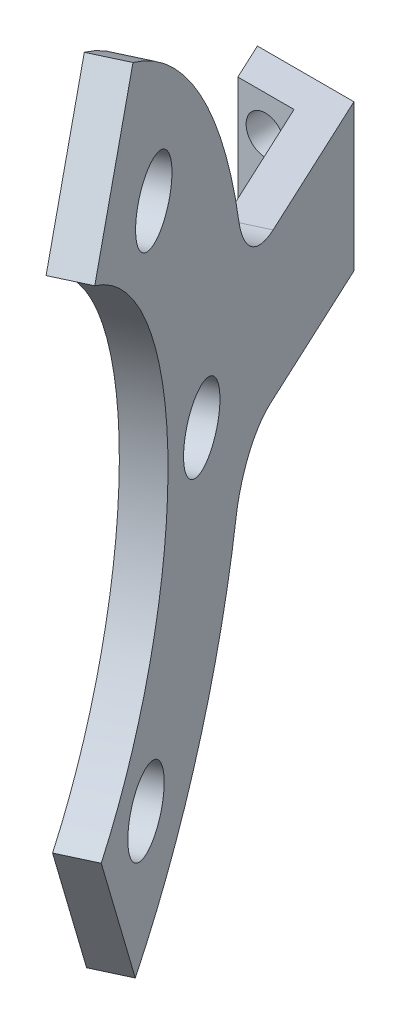
ISO-10303-21;
HEADER;
FILE_DESCRIPTION(('STEP AP214'),'2;1');
FILE_NAME('part.step','',(''),(''),'','','');
FILE_SCHEMA(('AUTOMOTIVE_DESIGN { 1 0 10303 214 1 1 1 1 }'));
ENDSEC;
DATA;
#1=APPLICATION_CONTEXT('core data for automotive mechanical design processes');
#2=APPLICATION_PROTOCOL_DEFINITION('international standard','automotive_design',2000,#1);
#3=PRODUCT_CONTEXT('',#1,'mechanical');
#4=PRODUCT('Part','Part','',(#3));
#5=PRODUCT_RELATED_PRODUCT_CATEGORY('part','',(#4));
#6=PRODUCT_DEFINITION_FORMATION('','',#4);
#7=PRODUCT_DEFINITION_CONTEXT('part definition',#1,'design');
#8=PRODUCT_DEFINITION('design','',#6,#7);
#9=PRODUCT_DEFINITION_SHAPE('','',#8);
#10=(LENGTH_UNIT() NAMED_UNIT(*) SI_UNIT(.MILLI.,.METRE.));
#11=(NAMED_UNIT(*) PLANE_ANGLE_UNIT() SI_UNIT($,.RADIAN.));
#12=(NAMED_UNIT(*) SI_UNIT($,.STERADIAN.) SOLID_ANGLE_UNIT());
#13=UNCERTAINTY_MEASURE_WITH_UNIT(LENGTH_MEASURE(1.E-05),#10,'distance_accuracy_value','');
#14=(GEOMETRIC_REPRESENTATION_CONTEXT(3) GLOBAL_UNCERTAINTY_ASSIGNED_CONTEXT((#13)) GLOBAL_UNIT_ASSIGNED_CONTEXT((#10,
#11,#12)) REPRESENTATION_CONTEXT('',''));
#15=CARTESIAN_POINT('',(0.,0.,0.));
#16=DIRECTION('',(0.,0.,1.));
#17=DIRECTION('',(1.,0.,0.));
#18=AXIS2_PLACEMENT_3D('',#15,#16,#17);
#19=CARTESIAN_POINT('',(21.9969620581679,8.,0.));
#20=DIRECTION('',(0.906307787036651,0.,-0.422618261740697));
#21=DIRECTION('',(-0.422618261740697,0.,-0.906307787036651));
#22=AXIS2_PLACEMENT_3D('',#19,#20,#21);
#23=PLANE('',#22);
#24=DIRECTION('',(0.422618261740697,0.,0.906307787036651));
#25=VECTOR('',#24,1.);
#26=CARTESIAN_POINT('',(21.9969620581679,0.,0.));
#27=LINE('',#26,#25);
#28=CARTESIAN_POINT('',(21.9969620581679,0.,0.));
#29=VERTEX_POINT('',#28);
#30=CARTESIAN_POINT('',(22.9295773744779,0.,2.));
#31=VERTEX_POINT('',#30);
#32=EDGE_CURVE('E162',#29,#31,#27,.T.);
#33=ORIENTED_EDGE('',*,*,#32,.T.);
#34=DIRECTION('',(0.,-1.,0.));
#35=VECTOR('',#34,1.);
#36=CARTESIAN_POINT('',(22.9295773744779,8.,2.));
#37=LINE('',#36,#35);
#38=CARTESIAN_POINT('',(22.9295773744779,8.,2.));
#39=VERTEX_POINT('',#38);
#40=EDGE_CURVE('E212',#39,#31,#37,.T.);
#41=ORIENTED_EDGE('',*,*,#40,.F.);
#42=DIRECTION('',(0.422618261740697,0.,0.906307787036651));
#43=VECTOR('',#42,1.);
#44=CARTESIAN_POINT('',(21.9969620581679,8.,0.));
#45=LINE('',#44,#43);
#46=CARTESIAN_POINT('',(21.9969620581679,8.,0.));
#47=VERTEX_POINT('',#46);
#48=EDGE_CURVE('E168',#47,#39,#45,.T.);
#49=ORIENTED_EDGE('',*,*,#48,.F.);
#50=DIRECTION('',(0.,-1.,0.));
#51=VECTOR('',#50,1.);
#52=CARTESIAN_POINT('',(21.9969620581679,8.,0.));
#53=LINE('',#52,#51);
#54=EDGE_CURVE('E185',#47,#29,#53,.T.);
#55=ORIENTED_EDGE('',*,*,#54,.T.);
#56=EDGE_LOOP('',(#33,#41,#49,#55));
#57=FACE_BOUND('',#56,.T.);
#58=ADVANCED_FACE('F40',(#57),#23,.F.);
#59=CARTESIAN_POINT('',(22.9295773744779,8.,2.));
#60=DIRECTION('',(0.,0.,-1.));
#61=DIRECTION('',(-1.,0.,0.));
#62=AXIS2_PLACEMENT_3D('',#59,#60,#61);
#63=PLANE('',#62);
#64=CARTESIAN_POINT('',(24.4295773744779,6.,2.));
#65=DIRECTION('',(0.,0.,1.));
#66=DIRECTION('',(1.,0.,0.));
#67=AXIS2_PLACEMENT_3D('',#64,#65,#66);
#68=CIRCLE('',#67,1.05);
#69=CARTESIAN_POINT('',(25.4795773744779,6.,2.));
#70=VERTEX_POINT('',#69);
#71=EDGE_CURVE('E322',#70,#70,#68,.T.);
#72=ORIENTED_EDGE('',*,*,#71,.F.);
#73=EDGE_LOOP('',(#72));
#74=FACE_BOUND('',#73,.T.);
#75=CARTESIAN_POINT('',(24.4295773744779,2.,2.));
#76=DIRECTION('',(0.,0.,1.));
#77=DIRECTION('',(1.,0.,0.));
#78=AXIS2_PLACEMENT_3D('',#75,#76,#77);
#79=CIRCLE('',#78,1.05);
#80=CARTESIAN_POINT('',(25.4795773744779,2.,2.));
#81=VERTEX_POINT('',#80);
#82=EDGE_CURVE('E314',#81,#81,#79,.T.);
#83=ORIENTED_EDGE('',*,*,#82,.F.);
#84=EDGE_LOOP('',(#83));
#85=FACE_BOUND('',#84,.T.);
#86=DIRECTION('',(1.,0.,0.));
#87=VECTOR('',#86,1.);
#88=CARTESIAN_POINT('',(22.9295773744779,0.,2.));
#89=LINE('',#88,#87);
#90=CARTESIAN_POINT('',(25.9969620581679,0.,2.));
#91=VERTEX_POINT('',#90);
#92=EDGE_CURVE('E189',#31,#91,#89,.T.);
#93=ORIENTED_EDGE('',*,*,#92,.T.);
#94=DIRECTION('',(0.,-1.,0.));
#95=VECTOR('',#94,1.);
#96=CARTESIAN_POINT('',(25.9969620581679,8.,2.));
#97=LINE('',#96,#95);
#98=CARTESIAN_POINT('',(25.9969620581679,8.,2.));
#99=VERTEX_POINT('',#98);
#100=EDGE_CURVE('E208',#99,#91,#97,.T.);
#101=ORIENTED_EDGE('',*,*,#100,.F.);
#102=DIRECTION('',(1.,0.,0.));
#103=VECTOR('',#102,1.);
#104=CARTESIAN_POINT('',(22.9295773744779,8.,2.));
#105=LINE('',#104,#103);
#106=EDGE_CURVE('E172',#39,#99,#105,.T.);
#107=ORIENTED_EDGE('',*,*,#106,.F.);
#108=ORIENTED_EDGE('',*,*,#40,.T.);
#109=EDGE_LOOP('',(#93,#101,#107,#108));
#110=FACE_BOUND('',#109,.T.);
#111=ADVANCED_FACE('F340',(#74,#85,#110),#63,.F.);
#112=CARTESIAN_POINT('',(25.9969620581679,8.,2.));
#113=DIRECTION('',(0.906307787036651,0.,-0.422618261740697));
#114=DIRECTION('',(-0.422618261740697,0.,-0.906307787036651));
#115=AXIS2_PLACEMENT_3D('',#112,#113,#114);
#116=PLANE('',#115);
#117=DIRECTION('',(0.422618261740697,0.,0.906307787036651));
#118=VECTOR('',#117,1.);
#119=CARTESIAN_POINT('',(25.9969620581679,0.,2.));
#120=LINE('',#119,#118);
#121=CARTESIAN_POINT('',(29.4639816523189,0.,9.43504751319924));
#122=VERTEX_POINT('',#121);
#123=EDGE_CURVE('E192',#91,#122,#120,.T.);
#124=ORIENTED_EDGE('',*,*,#123,.T.);
#125=CARTESIAN_POINT('',(29.463981652319,-4.,9.43504751319924));
#126=DIRECTION('',(0.906307787036651,0.,-0.422618261740697));
#127=DIRECTION('',(-0.422618261740697,0.,-0.906307787036651));
#128=AXIS2_PLACEMENT_3D('',#125,#126,#127);
#129=CIRCLE('',#128,4.);
#130=CARTESIAN_POINT('',(31.0780209575543,-2.81081892074349,12.8963659732508));
#131=VERTEX_POINT('',#130);
#132=EDGE_CURVE('E249',#122,#131,#129,.T.);
#133=ORIENTED_EDGE('',*,*,#132,.T.);
#134=CARTESIAN_POINT('',(41.1657666152749,4.62156282460973,34.5296063485732));
#135=DIRECTION('',(0.906307787036651,0.,-0.422618261740697));
#136=DIRECTION('',(-0.422618261740697,0.,-0.906307787036651));
#137=AXIS2_PLACEMENT_3D('',#134,#135,#136);
#138=CIRCLE('',#137,25.);
#139=CARTESIAN_POINT('',(30.9480034984025,10.9822845275324,12.6175426323129));
#140=VERTEX_POINT('',#139);
#141=EDGE_CURVE('E158',#131,#140,#138,.T.);
#142=ORIENTED_EDGE('',*,*,#141,.T.);
#143=CARTESIAN_POINT('',(29.313161399703,12.,9.11161243771124));
#144=DIRECTION('',(0.906307787036651,0.,-0.422618261740697));
#145=DIRECTION('',(-0.422618261740697,0.,-0.906307787036651));
#146=AXIS2_PLACEMENT_3D('',#143,#144,#145);
#147=CIRCLE('',#146,4.);
#148=CARTESIAN_POINT('',(29.313161399703,8.,9.11161243771124));
#149=VERTEX_POINT('',#148);
#150=EDGE_CURVE('E11',#140,#149,#147,.T.);
#151=ORIENTED_EDGE('',*,*,#150,.T.);
#152=DIRECTION('',(0.422618261740697,0.,0.906307787036651));
#153=VECTOR('',#152,1.);
#154=CARTESIAN_POINT('',(25.9969620581679,8.,2.));
#155=LINE('',#154,#153);
#156=EDGE_CURVE('E176',#99,#149,#155,.T.);
#157=ORIENTED_EDGE('',*,*,#156,.F.);
#158=ORIENTED_EDGE('',*,*,#100,.T.);
#159=EDGE_LOOP('',(#124,#133,#142,#151,#157,#158));
#160=FACE_BOUND('',#159,.T.);
#161=ADVANCED_FACE('F268',(#160),#116,.F.);
#162=CARTESIAN_POINT('',(27.2670300453605,8.,0.));
#163=DIRECTION('',(-0.906307787036651,0.,0.422618261740697));
#164=DIRECTION('',(0.422618261740697,0.,0.906307787036651));
#165=AXIS2_PLACEMENT_3D('',#162,#163,#164);
#166=PLANE('',#165);
#167=CARTESIAN_POINT('',(37.1869447665047,-9.9532528405021,21.2733257703586));
#168=DIRECTION('',(-0.906307787036651,0.,0.422618261740697));
#169=DIRECTION('',(0.422618261740697,0.,0.906307787036651));
#170=AXIS2_PLACEMENT_3D('',#167,#168,#169);
#171=CIRCLE('',#170,2.04999999999999);
#172=CARTESIAN_POINT('',(38.0533122030731,-9.9532528405021,23.1312567337837));
#173=VERTEX_POINT('',#172);
#174=EDGE_CURVE('E232',#173,#173,#171,.F.);
#175=ORIENTED_EDGE('',*,*,#174,.F.);
#176=EDGE_LOOP('',(#175));
#177=FACE_BOUND('',#176,.T.);
#178=CARTESIAN_POINT('',(36.8154537732224,18.3173559132924,20.4766607643577));
#179=DIRECTION('',(-0.906307787036651,0.,0.422618261740697));
#180=DIRECTION('',(0.422618261740697,0.,0.906307787036651));
#181=AXIS2_PLACEMENT_3D('',#178,#179,#180);
#182=CIRCLE('',#181,2.04999999999999);
#183=CARTESIAN_POINT('',(37.6818212097908,18.3173559132924,22.3345917277828));
#184=VERTEX_POINT('',#183);
#185=EDGE_CURVE('E227',#184,#184,#182,.F.);
#186=ORIENTED_EDGE('',*,*,#185,.F.);
#187=EDGE_LOOP('',(#186));
#188=FACE_BOUND('',#187,.T.);
#189=CARTESIAN_POINT('',(34.5267546482088,4.,15.5685296518019));
#190=DIRECTION('',(-0.906307787036651,0.,0.422618261740697));
#191=DIRECTION('',(0.422618261740697,0.,0.906307787036651));
#192=AXIS2_PLACEMENT_3D('',#189,#190,#191);
#193=CIRCLE('',#192,2.05);
#194=CARTESIAN_POINT('',(35.3931220847773,4.,17.4264606152271));
#195=VERTEX_POINT('',#194);
#196=EDGE_CURVE('E221',#195,#195,#193,.F.);
#197=ORIENTED_EDGE('',*,*,#196,.F.);
#198=EDGE_LOOP('',(#197));
#199=FACE_BOUND('',#198,.T.);
#200=DIRECTION('',(-0.422618261740697,0.,-0.906307787036651));
#201=VECTOR('',#200,1.);
#202=CARTESIAN_POINT('',(27.2670300453605,8.,0.));
#203=LINE('',#202,#201);
#204=CARTESIAN_POINT('',(31.1224318192317,8.,8.2679357854117));
#205=VERTEX_POINT('',#204);
#206=CARTESIAN_POINT('',(27.2670300453605,8.,0.));
#207=VERTEX_POINT('',#206);
#208=EDGE_CURVE('E179',#205,#207,#203,.T.);
#209=ORIENTED_EDGE('',*,*,#208,.F.);
#210=CARTESIAN_POINT('',(31.1224318192317,12.,8.2679357854117));
#211=DIRECTION('',(-0.906307787036651,0.,0.422618261740697));
#212=DIRECTION('',(0.422618261740697,0.,0.906307787036651));
#213=AXIS2_PLACEMENT_3D('',#210,#211,#212);
#214=CIRCLE('',#213,4.);
#215=CARTESIAN_POINT('',(32.7572739179313,10.9822845275324,11.7738659800133));
#216=VERTEX_POINT('',#215);
#217=EDGE_CURVE('E49',#205,#216,#214,.T.);
#218=ORIENTED_EDGE('',*,*,#217,.T.);
#219=CARTESIAN_POINT('',(42.9750370348036,4.62156282460973,33.6859296962736));
#220=DIRECTION('',(0.906307787036651,0.,-0.422618261740697));
#221=DIRECTION('',(-0.422618261740697,0.,-0.906307787036651));
#222=AXIS2_PLACEMENT_3D('',#219,#220,#221);
#223=CIRCLE('',#222,25.);
#224=CARTESIAN_POINT('',(37.8086821258694,26.4288608276341,22.6066458402556));
#225=VERTEX_POINT('',#224);
#226=EDGE_CURVE('E257',#216,#225,#223,.T.);
#227=ORIENTED_EDGE('',*,*,#226,.T.);
#228=DIRECTION('',(-0.206699302648591,0.872232080991051,-0.443268084994405));
#229=VECTOR('',#228,1.);
#230=CARTESIAN_POINT('',(39.6317016030034,18.7360623911966,26.5161237251932));
#231=LINE('',#230,#229);
#232=CARTESIAN_POINT('',(39.6317016030034,18.7360623911966,26.5161237251932));
#233=VERTEX_POINT('',#232);
#234=EDGE_CURVE('E263',#233,#225,#231,.T.);
#235=ORIENTED_EDGE('',*,*,#234,.F.);
#236=CARTESIAN_POINT('',(42.9750370348036,4.62156282460973,33.6859296962736));
#237=DIRECTION('',(0.906307787036651,0.,-0.422618261740697));
#238=DIRECTION('',(-0.422618261740697,0.,-0.906307787036651));
#239=AXIS2_PLACEMENT_3D('',#236,#237,#238);
#240=CIRCLE('',#239,16.1803308831325);
#241=CARTESIAN_POINT('',(39.3225517266587,-9.05725348798949,25.8531496758973));
#242=VERTEX_POINT('',#241);
#243=EDGE_CURVE('E156',#242,#233,#240,.T.);
#244=ORIENTED_EDGE('',*,*,#243,.F.);
#245=DIRECTION('',(-0.183398964974215,-0.900932658221316,-0.393300349601497));
#246=VECTOR('',#245,1.);
#247=CARTESIAN_POINT('',(39.3225517266587,-9.05725348798949,25.8531496758973));
#248=LINE('',#247,#246);
#249=CARTESIAN_POINT('',(37.6981420339057,-17.0370353953642,22.3695918480456));
#250=VERTEX_POINT('',#249);
#251=EDGE_CURVE('E152',#242,#250,#248,.T.);
#252=ORIENTED_EDGE('',*,*,#251,.T.);
#253=CARTESIAN_POINT('',(32.887291377083,-2.81081892074349,12.0526893209513));
#254=VERTEX_POINT('',#253);
#255=EDGE_CURVE('E262',#250,#254,#223,.T.);
#256=ORIENTED_EDGE('',*,*,#255,.T.);
#257=CARTESIAN_POINT('',(31.2732520718477,-4.,8.5913708608997));
#258=DIRECTION('',(-0.906307787036651,0.,0.422618261740697));
#259=DIRECTION('',(0.422618261740697,0.,0.906307787036651));
#260=AXIS2_PLACEMENT_3D('',#257,#258,#259);
#261=CIRCLE('',#260,4.);
#262=CARTESIAN_POINT('',(31.2732520718477,0.,8.5913708608997));
#263=VERTEX_POINT('',#262);
#264=EDGE_CURVE('E246',#254,#263,#261,.T.);
#265=ORIENTED_EDGE('',*,*,#264,.T.);
#266=DIRECTION('',(-0.422618261740697,0.,-0.906307787036651));
#267=VECTOR('',#266,1.);
#268=CARTESIAN_POINT('',(27.2670300453605,0.,0.));
#269=LINE('',#268,#267);
#270=CARTESIAN_POINT('',(27.2670300453605,0.,0.));
#271=VERTEX_POINT('',#270);
#272=EDGE_CURVE('E196',#263,#271,#269,.T.);
#273=ORIENTED_EDGE('',*,*,#272,.T.);
#274=DIRECTION('',(0.,-1.,0.));
#275=VECTOR('',#274,1.);
#276=CARTESIAN_POINT('',(27.2670300453605,8.,0.));
#277=LINE('',#276,#275);
#278=EDGE_CURVE('E204',#207,#271,#277,.T.);
#279=ORIENTED_EDGE('',*,*,#278,.F.);
#280=EDGE_LOOP('',(#209,#218,#227,#235,#244,#252,#256,#265,#273,#279));
#281=FACE_BOUND('',#280,.T.);
#282=ADVANCED_FACE('F256',(#177,#188,#199,#281),#166,.F.);
#283=CARTESIAN_POINT('',(27.2670300453605,8.,0.));
#284=DIRECTION('',(0.,0.,1.));
#285=DIRECTION('',(1.,0.,0.));
#286=AXIS2_PLACEMENT_3D('',#283,#284,#285);
#287=PLANE('',#286);
#288=CARTESIAN_POINT('',(24.4295773744779,6.,0.));
#289=DIRECTION('',(0.,0.,1.));
#290=DIRECTION('',(1.,0.,0.));
#291=AXIS2_PLACEMENT_3D('',#288,#289,#290);
#292=CIRCLE('',#291,1.05);
#293=CARTESIAN_POINT('',(25.4795773744779,6.,0.));
#294=VERTEX_POINT('',#293);
#295=EDGE_CURVE('E222',#294,#294,#292,.T.);
#296=ORIENTED_EDGE('',*,*,#295,.T.);
#297=EDGE_LOOP('',(#296));
#298=FACE_BOUND('',#297,.T.);
#299=CARTESIAN_POINT('',(24.4295773744779,2.,0.));
#300=DIRECTION('',(0.,0.,1.));
#301=DIRECTION('',(1.,0.,0.));
#302=AXIS2_PLACEMENT_3D('',#299,#300,#301);
#303=CIRCLE('',#302,1.05);
#304=CARTESIAN_POINT('',(25.4795773744779,2.,0.));
#305=VERTEX_POINT('',#304);
#306=EDGE_CURVE('E318',#305,#305,#303,.T.);
#307=ORIENTED_EDGE('',*,*,#306,.T.);
#308=EDGE_LOOP('',(#307));
#309=FACE_BOUND('',#308,.T.);
#310=DIRECTION('',(-1.,0.,0.));
#311=VECTOR('',#310,1.);
#312=CARTESIAN_POINT('',(27.2670300453605,0.,0.));
#313=LINE('',#312,#311);
#314=EDGE_CURVE('E173',#271,#29,#313,.T.);
#315=ORIENTED_EDGE('',*,*,#314,.T.);
#316=ORIENTED_EDGE('',*,*,#54,.F.);
#317=DIRECTION('',(-1.,0.,0.));
#318=VECTOR('',#317,1.);
#319=CARTESIAN_POINT('',(27.2670300453605,8.,0.));
#320=LINE('',#319,#318);
#321=EDGE_CURVE('E182',#207,#47,#320,.T.);
#322=ORIENTED_EDGE('',*,*,#321,.F.);
#323=ORIENTED_EDGE('',*,*,#278,.T.);
#324=EDGE_LOOP('',(#315,#316,#322,#323));
#325=FACE_BOUND('',#324,.T.);
#326=ADVANCED_FACE('F330',(#298,#309,#325),#287,.F.);
#327=CARTESIAN_POINT('',(0.,8.,0.));
#328=DIRECTION('',(0.,-1.,0.));
#329=DIRECTION('',(0.,0.,-1.));
#330=AXIS2_PLACEMENT_3D('',#327,#328,#329);
#331=PLANE('',#330);
#332=ORIENTED_EDGE('',*,*,#156,.T.);
#333=DIRECTION('',(0.906307787036651,0.,-0.422618261740697));
#334=VECTOR('',#333,1.);
#335=CARTESIAN_POINT('',(8.72546226349724,8.,18.711814208715));
#336=LINE('',#335,#334);
#337=EDGE_CURVE('E243',#149,#205,#336,.T.);
#338=ORIENTED_EDGE('',*,*,#337,.T.);
#339=ORIENTED_EDGE('',*,*,#208,.T.);
#340=ORIENTED_EDGE('',*,*,#321,.T.);
#341=ORIENTED_EDGE('',*,*,#48,.T.);
#342=ORIENTED_EDGE('',*,*,#106,.T.);
#343=EDGE_LOOP('',(#332,#338,#339,#340,#341,#342));
#344=FACE_BOUND('',#343,.T.);
#345=ADVANCED_FACE('F266',(#344),#331,.F.);
#346=CARTESIAN_POINT('',(0.,0.,0.));
#347=DIRECTION('',(0.,-1.,0.));
#348=DIRECTION('',(0.,0.,-1.));
#349=AXIS2_PLACEMENT_3D('',#346,#347,#348);
#350=PLANE('',#349);
#351=ORIENTED_EDGE('',*,*,#272,.F.);
#352=DIRECTION('',(-0.906307787036651,0.,0.422618261740697));
#353=VECTOR('',#352,1.);
#354=CARTESIAN_POINT('',(29.4639816523189,0.,9.43504751319924));
#355=LINE('',#354,#353);
#356=EDGE_CURVE('E240',#263,#122,#355,.T.);
#357=ORIENTED_EDGE('',*,*,#356,.T.);
#358=ORIENTED_EDGE('',*,*,#123,.F.);
#359=ORIENTED_EDGE('',*,*,#92,.F.);
#360=ORIENTED_EDGE('',*,*,#32,.F.);
#361=ORIENTED_EDGE('',*,*,#314,.F.);
#362=EDGE_LOOP('',(#351,#357,#358,#359,#360,#361));
#363=FACE_BOUND('',#362,.T.);
#364=ADVANCED_FACE('F274',(#363),#350,.T.);
#365=CARTESIAN_POINT('',(41.1624214607304,4.62156282460973,34.531166219755));
#366=DIRECTION('',(0.906307787036651,0.,-0.422618261740697));
#367=DIRECTION('',(-0.422618261740697,0.,-0.906307787036651));
#368=AXIS2_PLACEMENT_3D('',#365,#366,#367);
#369=CYLINDRICAL_SURFACE('',#368,25.);
#370=ORIENTED_EDGE('',*,*,#141,.F.);
#371=DIRECTION('',(0.906307787036651,0.,-0.422618261740697));
#372=VECTOR('',#371,1.);
#373=CARTESIAN_POINT('',(31.0746758030097,-2.81081892074349,12.8979258444327));
#374=LINE('',#373,#372);
#375=EDGE_CURVE('E236',#131,#254,#374,.T.);
#376=ORIENTED_EDGE('',*,*,#375,.T.);
#377=ORIENTED_EDGE('',*,*,#255,.F.);
#378=DIRECTION('',(0.906307787036651,0.,-0.422618261740697));
#379=VECTOR('',#378,1.);
#380=CARTESIAN_POINT('',(35.8855264598324,-17.0370353953642,23.2148283715269));
#381=LINE('',#380,#379);
#382=CARTESIAN_POINT('',(35.8855264598324,-17.0370353953642,23.2148283715269));
#383=VERTEX_POINT('',#382);
#384=EDGE_CURVE('E164',#383,#250,#381,.T.);
#385=ORIENTED_EDGE('',*,*,#384,.F.);
#386=CARTESIAN_POINT('',(41.1624214607304,4.62156282460973,34.531166219755));
#387=DIRECTION('',(0.906307787036651,0.,-0.422618261740697));
#388=DIRECTION('',(-0.422618261740697,0.,-0.906307787036651));
#389=AXIS2_PLACEMENT_3D('',#386,#387,#388);
#390=CIRCLE('',#389,25.);
#391=CARTESIAN_POINT('',(35.9960665517961,26.4288608276341,23.451882363737));
#392=VERTEX_POINT('',#391);
#393=EDGE_CURVE('E142',#383,#392,#390,.T.);
#394=ORIENTED_EDGE('',*,*,#393,.T.);
#395=DIRECTION('',(0.906307787036651,0.,-0.422618261740697));
#396=VECTOR('',#395,1.);
#397=CARTESIAN_POINT('',(35.9960665517961,26.4288608276341,23.451882363737));
#398=LINE('',#397,#396);
#399=EDGE_CURVE('E137',#392,#225,#398,.T.);
#400=ORIENTED_EDGE('',*,*,#399,.T.);
#401=ORIENTED_EDGE('',*,*,#226,.F.);
#402=DIRECTION('',(0.906307787036651,0.,-0.422618261740697));
#403=VECTOR('',#402,1.);
#404=CARTESIAN_POINT('',(30.944658343858,10.9822845275324,12.6191025034947));
#405=LINE('',#404,#403);
#406=EDGE_CURVE('E216',#216,#140,#405,.F.);
#407=ORIENTED_EDGE('',*,*,#406,.T.);
#408=EDGE_LOOP('',(#370,#376,#377,#385,#394,#400,#401,#407));
#409=FACE_BOUND('',#408,.T.);
#410=ADVANCED_FACE('F260',(#409),#369,.T.);
#411=CARTESIAN_POINT('',(41.1624214607304,4.62156282460973,34.531166219755));
#412=DIRECTION('',(0.906307787036651,0.,-0.422618261740697));
#413=DIRECTION('',(-0.422618261740697,0.,-0.906307787036651));
#414=AXIS2_PLACEMENT_3D('',#411,#412,#413);
#415=CYLINDRICAL_SURFACE('',#414,16.1803308831325);
#416=ORIENTED_EDGE('',*,*,#243,.T.);
#417=DIRECTION('',(0.906307787036651,0.,-0.422618261740697));
#418=VECTOR('',#417,1.);
#419=CARTESIAN_POINT('',(37.8190860289301,18.7360623911966,27.3613602486746));
#420=LINE('',#419,#418);
#421=CARTESIAN_POINT('',(37.8190860289301,18.7360623911966,27.3613602486746));
#422=VERTEX_POINT('',#421);
#423=EDGE_CURVE('E134',#422,#233,#420,.T.);
#424=ORIENTED_EDGE('',*,*,#423,.F.);
#425=CARTESIAN_POINT('',(41.1624214607304,4.62156282460973,34.531166219755));
#426=DIRECTION('',(0.906307787036651,0.,-0.422618261740697));
#427=DIRECTION('',(-0.422618261740697,0.,-0.906307787036651));
#428=AXIS2_PLACEMENT_3D('',#425,#426,#427);
#429=CIRCLE('',#428,16.1803308831325);
#430=CARTESIAN_POINT('',(37.5099361525854,-9.05725348798949,26.6983861993787));
#431=VERTEX_POINT('',#430);
#432=EDGE_CURVE('E143',#431,#422,#429,.T.);
#433=ORIENTED_EDGE('',*,*,#432,.F.);
#434=DIRECTION('',(0.906307787036651,0.,-0.422618261740697));
#435=VECTOR('',#434,1.);
#436=CARTESIAN_POINT('',(37.5099361525854,-9.05725348798949,26.6983861993787));
#437=LINE('',#436,#435);
#438=EDGE_CURVE('E291',#431,#242,#437,.T.);
#439=ORIENTED_EDGE('',*,*,#438,.T.);
#440=EDGE_LOOP('',(#416,#424,#433,#439));
#441=FACE_BOUND('',#440,.T.);
#442=ADVANCED_FACE('F154',(#441),#415,.F.);
#443=CARTESIAN_POINT('',(37.8190860289301,18.7360623911966,27.3613602486746));
#444=DIRECTION('',(-0.368621205902909,-0.489092217163615,-0.790510727105373));
#445=DIRECTION('',(0.,0.850395864536416,-0.526143396403833));
#446=AXIS2_PLACEMENT_3D('',#443,#444,#445);
#447=PLANE('',#446);
#448=ORIENTED_EDGE('',*,*,#234,.T.);
#449=ORIENTED_EDGE('',*,*,#399,.F.);
#450=DIRECTION('',(-0.206699302648591,0.872232080991051,-0.443268084994405));
#451=VECTOR('',#450,1.);
#452=CARTESIAN_POINT('',(37.8190860289301,18.7360623911966,27.3613602486746));
#453=LINE('',#452,#451);
#454=EDGE_CURVE('E129',#422,#392,#453,.T.);
#455=ORIENTED_EDGE('',*,*,#454,.F.);
#456=ORIENTED_EDGE('',*,*,#423,.T.);
#457=EDGE_LOOP('',(#448,#449,#455,#456));
#458=FACE_BOUND('',#457,.T.);
#459=ADVANCED_FACE('F132',(#458),#447,.F.);
#460=CARTESIAN_POINT('',(37.5099361525854,-9.05725348798949,26.6983861993787));
#461=DIRECTION('',(0.380750593962918,-0.433958921270519,0.816522283741609));
#462=DIRECTION('',(0.,-0.883034400690557,-0.469308264573584));
#463=AXIS2_PLACEMENT_3D('',#460,#461,#462);
#464=PLANE('',#463);
#465=ORIENTED_EDGE('',*,*,#251,.F.);
#466=ORIENTED_EDGE('',*,*,#438,.F.);
#467=DIRECTION('',(-0.183398964974215,-0.900932658221316,-0.393300349601497));
#468=VECTOR('',#467,1.);
#469=CARTESIAN_POINT('',(37.5099361525854,-9.05725348798949,26.6983861993787));
#470=LINE('',#469,#468);
#471=EDGE_CURVE('E149',#431,#383,#470,.T.);
#472=ORIENTED_EDGE('',*,*,#471,.T.);
#473=ORIENTED_EDGE('',*,*,#384,.T.);
#474=EDGE_LOOP('',(#465,#466,#472,#473));
#475=FACE_BOUND('',#474,.T.);
#476=ADVANCED_FACE('F295',(#475),#464,.T.);
#477=CARTESIAN_POINT('',(41.1624214607304,4.62156282460973,34.531166219755));
#478=DIRECTION('',(0.906307787036651,0.,-0.422618261740697));
#479=DIRECTION('',(-0.422618261740697,0.,-0.906307787036651));
#480=AXIS2_PLACEMENT_3D('',#477,#478,#479);
#481=PLANE('',#480);
#482=CARTESIAN_POINT('',(35.3743291924314,-9.9532528405021,22.1185622938399));
#483=DIRECTION('',(0.906307787036651,0.,-0.422618261740697));
#484=DIRECTION('',(-0.422618261740697,0.,-0.906307787036651));
#485=AXIS2_PLACEMENT_3D('',#482,#483,#484);
#486=CIRCLE('',#485,2.04999999999999);
#487=CARTESIAN_POINT('',(34.507961755863,-9.9532528405021,20.2606313304148));
#488=VERTEX_POINT('',#487);
#489=EDGE_CURVE('E228',#488,#488,#486,.F.);
#490=ORIENTED_EDGE('',*,*,#489,.F.);
#491=EDGE_LOOP('',(#490));
#492=FACE_BOUND('',#491,.T.);
#493=CARTESIAN_POINT('',(35.0028381991491,18.3173559132924,21.3218972878391));
#494=DIRECTION('',(0.906307787036651,0.,-0.422618261740697));
#495=DIRECTION('',(-0.422618261740697,0.,-0.906307787036651));
#496=AXIS2_PLACEMENT_3D('',#493,#494,#495);
#497=CIRCLE('',#496,2.04999999999999);
#498=CARTESIAN_POINT('',(34.1364707625807,18.3173559132924,19.463966324414));
#499=VERTEX_POINT('',#498);
#500=EDGE_CURVE('E223',#499,#499,#497,.F.);
#501=ORIENTED_EDGE('',*,*,#500,.F.);
#502=EDGE_LOOP('',(#501));
#503=FACE_BOUND('',#502,.T.);
#504=CARTESIAN_POINT('',(32.7141390741355,4.,16.4137661752833));
#505=DIRECTION('',(0.906307787036651,0.,-0.422618261740697));
#506=DIRECTION('',(-0.422618261740697,0.,-0.906307787036651));
#507=AXIS2_PLACEMENT_3D('',#504,#505,#506);
#508=CIRCLE('',#507,2.05);
#509=CARTESIAN_POINT('',(31.8477716375671,4.,14.5558352118582));
#510=VERTEX_POINT('',#509);
#511=EDGE_CURVE('E217',#510,#510,#508,.F.);
#512=ORIENTED_EDGE('',*,*,#511,.F.);
#513=EDGE_LOOP('',(#512));
#514=FACE_BOUND('',#513,.T.);
#515=ORIENTED_EDGE('',*,*,#432,.T.);
#516=ORIENTED_EDGE('',*,*,#454,.T.);
#517=ORIENTED_EDGE('',*,*,#393,.F.);
#518=ORIENTED_EDGE('',*,*,#471,.F.);
#519=EDGE_LOOP('',(#515,#516,#517,#518));
#520=FACE_BOUND('',#519,.T.);
#521=ADVANCED_FACE('F147',(#492,#503,#514,#520),#481,.F.);
#522=CARTESIAN_POINT('',(23.6544063583136,4.,20.6383889215084));
#523=DIRECTION('',(0.906307787036651,0.,-0.422618261740697));
#524=DIRECTION('',(-0.422618261740697,0.,-0.906307787036651));
#525=AXIS2_PLACEMENT_3D('',#522,#523,#524);
#526=CYLINDRICAL_SURFACE('',#525,2.05);
#527=ORIENTED_EDGE('',*,*,#511,.T.);
#528=EDGE_LOOP('',(#527));
#529=FACE_BOUND('',#528,.T.);
#530=ORIENTED_EDGE('',*,*,#196,.T.);
#531=EDGE_LOOP('',(#530));
#532=FACE_BOUND('',#531,.T.);
#533=ADVANCED_FACE('F380',(#529,#532),#526,.F.);
#534=CARTESIAN_POINT('',(25.9431054833272,18.3173559132924,25.5465200340642));
#535=DIRECTION('',(0.906307787036651,0.,-0.422618261740697));
#536=DIRECTION('',(-0.422618261740697,0.,-0.906307787036651));
#537=AXIS2_PLACEMENT_3D('',#534,#535,#536);
#538=CYLINDRICAL_SURFACE('',#537,2.04999999999999);
#539=ORIENTED_EDGE('',*,*,#500,.T.);
#540=EDGE_LOOP('',(#539));
#541=FACE_BOUND('',#540,.T.);
#542=ORIENTED_EDGE('',*,*,#185,.T.);
#543=EDGE_LOOP('',(#542));
#544=FACE_BOUND('',#543,.T.);
#545=ADVANCED_FACE('F374',(#541,#544),#538,.F.);
#546=CARTESIAN_POINT('',(26.3145964766095,-9.9532528405021,26.3431850400651));
#547=DIRECTION('',(0.906307787036651,0.,-0.422618261740697));
#548=DIRECTION('',(-0.422618261740697,0.,-0.906307787036651));
#549=AXIS2_PLACEMENT_3D('',#546,#547,#548);
#550=CYLINDRICAL_SURFACE('',#549,2.04999999999999);
#551=ORIENTED_EDGE('',*,*,#489,.T.);
#552=EDGE_LOOP('',(#551));
#553=FACE_BOUND('',#552,.T.);
#554=ORIENTED_EDGE('',*,*,#174,.T.);
#555=EDGE_LOOP('',(#554));
#556=FACE_BOUND('',#555,.T.);
#557=ADVANCED_FACE('F369',(#553,#556),#550,.F.);
#558=CARTESIAN_POINT('',(29.4606364977744,-4.,9.43660738438109));
#559=DIRECTION('',(0.906307787036651,0.,-0.422618261740697));
#560=DIRECTION('',(-0.422618261740697,0.,-0.906307787036651));
#561=AXIS2_PLACEMENT_3D('',#558,#559,#560);
#562=CYLINDRICAL_SURFACE('',#561,4.);
#563=ORIENTED_EDGE('',*,*,#132,.F.);
#564=ORIENTED_EDGE('',*,*,#356,.F.);
#565=ORIENTED_EDGE('',*,*,#264,.F.);
#566=ORIENTED_EDGE('',*,*,#375,.F.);
#567=EDGE_LOOP('',(#563,#564,#565,#566));
#568=FACE_BOUND('',#567,.T.);
#569=ADVANCED_FACE('F279',(#568),#562,.F.);
#570=CARTESIAN_POINT('',(29.3098162451584,12.,9.11317230889309));
#571=DIRECTION('',(0.906307787036651,0.,-0.422618261740697));
#572=DIRECTION('',(-0.422618261740697,0.,-0.906307787036651));
#573=AXIS2_PLACEMENT_3D('',#570,#571,#572);
#574=CYLINDRICAL_SURFACE('',#573,4.);
#575=ORIENTED_EDGE('',*,*,#150,.F.);
#576=ORIENTED_EDGE('',*,*,#406,.F.);
#577=ORIENTED_EDGE('',*,*,#217,.F.);
#578=ORIENTED_EDGE('',*,*,#337,.F.);
#579=EDGE_LOOP('',(#575,#576,#577,#578));
#580=FACE_BOUND('',#579,.T.);
#581=ADVANCED_FACE('F42',(#580),#574,.F.);
#582=CARTESIAN_POINT('',(24.4295773744779,2.,0.));
#583=DIRECTION('',(0.,0.,1.));
#584=DIRECTION('',(1.,0.,0.));
#585=AXIS2_PLACEMENT_3D('',#582,#583,#584);
#586=CYLINDRICAL_SURFACE('',#585,1.05);
#587=ORIENTED_EDGE('',*,*,#306,.F.);
#588=EDGE_LOOP('',(#587));
#589=FACE_BOUND('',#588,.T.);
#590=ORIENTED_EDGE('',*,*,#82,.T.);
#591=EDGE_LOOP('',(#590));
#592=FACE_BOUND('',#591,.T.);
#593=ADVANCED_FACE('F336',(#589,#592),#586,.F.);
#594=CARTESIAN_POINT('',(24.4295773744779,6.,0.));
#595=DIRECTION('',(0.,0.,1.));
#596=DIRECTION('',(1.,0.,0.));
#597=AXIS2_PLACEMENT_3D('',#594,#595,#596);
#598=CYLINDRICAL_SURFACE('',#597,1.05);
#599=ORIENTED_EDGE('',*,*,#295,.F.);
#600=EDGE_LOOP('',(#599));
#601=FACE_BOUND('',#600,.T.);
#602=ORIENTED_EDGE('',*,*,#71,.T.);
#603=EDGE_LOOP('',(#602));
#604=FACE_BOUND('',#603,.T.);
#605=ADVANCED_FACE('F333',(#601,#604),#598,.F.);
#606=CLOSED_SHELL('',(#58,#111,#161,#282,#326,#345,#364,#410,#442,#459,#476,#521,#533,#545,#557,
#569,#581,#593,#605));
#607=MANIFOLD_SOLID_BREP('B2',#606);
#608=ADVANCED_BREP_SHAPE_REPRESENTATION('',(#18,#607),#14);
#609=SHAPE_DEFINITION_REPRESENTATION(#9,#608);
ENDSEC;
END-ISO-10303-21;
